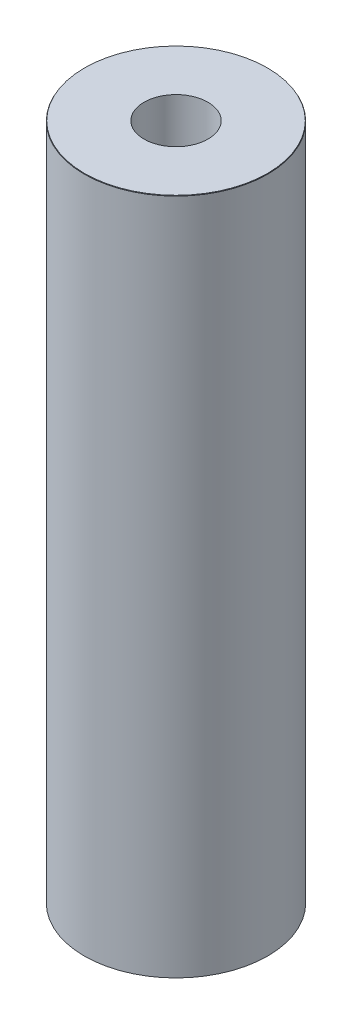
ISO-10303-21;
HEADER;
FILE_DESCRIPTION(('STEP AP214'),'2;1');
FILE_NAME('part.step','',(''),(''),'','','');
FILE_SCHEMA(('AUTOMOTIVE_DESIGN { 1 0 10303 214 1 1 1 1 }'));
ENDSEC;
DATA;
#1=APPLICATION_CONTEXT('core data for automotive mechanical design processes');
#2=APPLICATION_PROTOCOL_DEFINITION('international standard','automotive_design',2000,#1);
#3=PRODUCT_CONTEXT('',#1,'mechanical');
#4=PRODUCT('Part','Part','',(#3));
#5=PRODUCT_RELATED_PRODUCT_CATEGORY('part','',(#4));
#6=PRODUCT_DEFINITION_FORMATION('','',#4);
#7=PRODUCT_DEFINITION_CONTEXT('part definition',#1,'design');
#8=PRODUCT_DEFINITION('design','',#6,#7);
#9=PRODUCT_DEFINITION_SHAPE('','',#8);
#10=(LENGTH_UNIT() NAMED_UNIT(*) SI_UNIT(.MILLI.,.METRE.));
#11=(NAMED_UNIT(*) PLANE_ANGLE_UNIT() SI_UNIT($,.RADIAN.));
#12=(NAMED_UNIT(*) SI_UNIT($,.STERADIAN.) SOLID_ANGLE_UNIT());
#13=UNCERTAINTY_MEASURE_WITH_UNIT(LENGTH_MEASURE(1.E-05),#10,'distance_accuracy_value','');
#14=(GEOMETRIC_REPRESENTATION_CONTEXT(3) GLOBAL_UNCERTAINTY_ASSIGNED_CONTEXT((#13)) GLOBAL_UNIT_ASSIGNED_CONTEXT((#10,
#11,#12)) REPRESENTATION_CONTEXT('',''));
#15=CARTESIAN_POINT('',(0.,0.,0.));
#16=DIRECTION('',(0.,0.,1.));
#17=DIRECTION('',(1.,0.,0.));
#18=AXIS2_PLACEMENT_3D('',#15,#16,#17);
#19=CARTESIAN_POINT('',(0.,351.051559551091,0.));
#20=DIRECTION('',(0.,-1.,0.));
#21=DIRECTION('',(0.,0.,-1.));
#22=AXIS2_PLACEMENT_3D('',#19,#20,#21);
#23=CYLINDRICAL_SURFACE('',#22,47.5);
#24=CARTESIAN_POINT('',(0.,350.787892875197,0.));
#25=DIRECTION('',(0.,1.,0.));
#26=DIRECTION('',(0.,0.,1.));
#27=AXIS2_PLACEMENT_3D('',#24,#25,#26);
#28=CIRCLE('',#27,47.5);
#29=CARTESIAN_POINT('',(0.,350.787892875197,47.5));
#30=VERTEX_POINT('',#29);
#31=EDGE_CURVE('E50',#30,#30,#28,.F.);
#32=ORIENTED_EDGE('',*,*,#31,.T.);
#33=EDGE_LOOP('',(#32));
#34=FACE_BOUND('',#33,.T.);
#35=CARTESIAN_POINT('',(0.,0.148490882919572,0.));
#36=DIRECTION('',(0.,1.,0.));
#37=DIRECTION('',(0.,0.,1.));
#38=AXIS2_PLACEMENT_3D('',#35,#36,#37);
#39=CIRCLE('',#38,47.5);
#40=CARTESIAN_POINT('',(0.,0.148490882919572,47.5));
#41=VERTEX_POINT('',#40);
#42=EDGE_CURVE('E51',#41,#41,#39,.T.);
#43=ORIENTED_EDGE('',*,*,#42,.T.);
#44=EDGE_LOOP('',(#43));
#45=FACE_BOUND('',#44,.T.);
#46=ADVANCED_FACE('F39',(#34,#45),#23,.T.);
#47=CARTESIAN_POINT('',(0.,351.051559551091,0.));
#48=DIRECTION('',(0.,1.,0.));
#49=DIRECTION('',(0.,0.,1.));
#50=AXIS2_PLACEMENT_3D('',#47,#48,#49);
#51=PLANE('',#50);
#52=CARTESIAN_POINT('',(0.,351.051559551091,0.));
#53=DIRECTION('',(0.,1.,0.));
#54=DIRECTION('',(0.,0.,1.));
#55=AXIS2_PLACEMENT_3D('',#52,#53,#54);
#56=CIRCLE('',#55,47.3515091170804);
#57=CARTESIAN_POINT('',(0.,351.051559551091,47.3515091170804));
#58=VERTEX_POINT('',#57);
#59=EDGE_CURVE('E54',#58,#58,#56,.T.);
#60=ORIENTED_EDGE('',*,*,#59,.T.);
#61=EDGE_LOOP('',(#60));
#62=FACE_BOUND('',#61,.T.);
#63=CARTESIAN_POINT('',(0.,351.051559551091,0.));
#64=DIRECTION('',(0.,1.,0.));
#65=DIRECTION('',(0.,0.,1.));
#66=AXIS2_PLACEMENT_3D('',#63,#64,#65);
#67=CIRCLE('',#66,16.5564820221306);
#68=CARTESIAN_POINT('',(0.,351.051559551091,16.5564820221306));
#69=VERTEX_POINT('',#68);
#70=EDGE_CURVE('E58',#69,#69,#67,.T.);
#71=ORIENTED_EDGE('',*,*,#70,.F.);
#72=EDGE_LOOP('',(#71));
#73=FACE_BOUND('',#72,.T.);
#74=ADVANCED_FACE('F69',(#62,#73),#51,.T.);
#75=CARTESIAN_POINT('',(0.,0.,0.));
#76=DIRECTION('',(0.,1.,0.));
#77=DIRECTION('',(0.,0.,1.));
#78=AXIS2_PLACEMENT_3D('',#75,#76,#77);
#79=PLANE('',#78);
#80=CARTESIAN_POINT('',(0.,0.,0.));
#81=DIRECTION('',(0.,1.,0.));
#82=DIRECTION('',(0.,0.,1.));
#83=AXIS2_PLACEMENT_3D('',#80,#81,#82);
#84=CIRCLE('',#83,47.2363333241058);
#85=CARTESIAN_POINT('',(0.,0.,47.2363333241058));
#86=VERTEX_POINT('',#85);
#87=EDGE_CURVE('E10',#86,#86,#84,.F.);
#88=ORIENTED_EDGE('',*,*,#87,.T.);
#89=EDGE_LOOP('',(#88));
#90=FACE_BOUND('',#89,.T.);
#91=CARTESIAN_POINT('',(0.,0.,0.));
#92=DIRECTION('',(0.,1.,0.));
#93=DIRECTION('',(0.,0.,1.));
#94=AXIS2_PLACEMENT_3D('',#91,#92,#93);
#95=CIRCLE('',#94,16.5564820221306);
#96=CARTESIAN_POINT('',(0.,0.,16.5564820221306));
#97=VERTEX_POINT('',#96);
#98=EDGE_CURVE('E63',#97,#97,#95,.T.);
#99=ORIENTED_EDGE('',*,*,#98,.T.);
#100=EDGE_LOOP('',(#99));
#101=FACE_BOUND('',#100,.T.);
#102=ADVANCED_FACE('F75',(#90,#101),#79,.F.);
#103=CARTESIAN_POINT('',(0.,351.051559551091,0.));
#104=DIRECTION('',(0.,-1.,0.));
#105=DIRECTION('',(0.,0.,-1.));
#106=AXIS2_PLACEMENT_3D('',#103,#104,#105);
#107=CYLINDRICAL_SURFACE('',#106,16.5564820221306);
#108=ORIENTED_EDGE('',*,*,#70,.T.);
#109=EDGE_LOOP('',(#108));
#110=FACE_BOUND('',#109,.T.);
#111=ORIENTED_EDGE('',*,*,#98,.F.);
#112=EDGE_LOOP('',(#111));
#113=FACE_BOUND('',#112,.T.);
#114=ADVANCED_FACE('F70',(#110,#113),#107,.F.);
#115=CARTESIAN_POINT('',(0.,351.051559551091,0.));
#116=DIRECTION('',(0.,-1.,0.));
#117=DIRECTION('',(0.,0.,-1.));
#118=AXIS2_PLACEMENT_3D('',#115,#116,#117);
#119=CONICAL_SURFACE('',#118,47.3515091170804,0.512903231664063);
#120=ORIENTED_EDGE('',*,*,#31,.F.);
#121=EDGE_LOOP('',(#120));
#122=FACE_BOUND('',#121,.T.);
#123=ORIENTED_EDGE('',*,*,#59,.F.);
#124=EDGE_LOOP('',(#123));
#125=FACE_BOUND('',#124,.T.);
#126=ADVANCED_FACE('F81',(#122,#125),#119,.T.);
#127=CARTESIAN_POINT('',(0.,0.148490882919572,0.));
#128=DIRECTION('',(0.,1.,0.));
#129=DIRECTION('',(0.,0.,1.));
#130=AXIS2_PLACEMENT_3D('',#127,#128,#129);
#131=CONICAL_SURFACE('',#130,47.5,1.05789309513101);
#132=ORIENTED_EDGE('',*,*,#87,.F.);
#133=EDGE_LOOP('',(#132));
#134=FACE_BOUND('',#133,.T.);
#135=ORIENTED_EDGE('',*,*,#42,.F.);
#136=EDGE_LOOP('',(#135));
#137=FACE_BOUND('',#136,.T.);
#138=ADVANCED_FACE('F45',(#134,#137),#131,.T.);
#139=CLOSED_SHELL('',(#46,#74,#102,#114,#126,#138));
#140=MANIFOLD_SOLID_BREP('B2',#139);
#141=ADVANCED_BREP_SHAPE_REPRESENTATION('',(#18,#140),#14);
#142=SHAPE_DEFINITION_REPRESENTATION(#9,#141);
ENDSEC;
END-ISO-10303-21;
